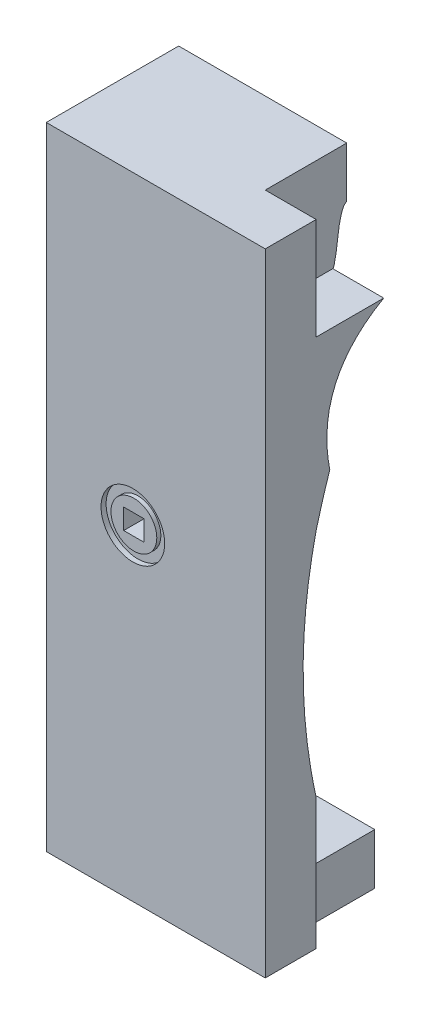
ISO-10303-21;
HEADER;
FILE_DESCRIPTION(('STEP AP214'),'2;1');
FILE_NAME('part.step','',(''),(''),'','','');
FILE_SCHEMA(('AUTOMOTIVE_DESIGN { 1 0 10303 214 1 1 1 1 }'));
ENDSEC;
DATA;
#1=APPLICATION_CONTEXT('core data for automotive mechanical design processes');
#2=APPLICATION_PROTOCOL_DEFINITION('international standard','automotive_design',2000,#1);
#3=PRODUCT_CONTEXT('',#1,'mechanical');
#4=PRODUCT('Part','Part','',(#3));
#5=PRODUCT_RELATED_PRODUCT_CATEGORY('part','',(#4));
#6=PRODUCT_DEFINITION_FORMATION('','',#4);
#7=PRODUCT_DEFINITION_CONTEXT('part definition',#1,'design');
#8=PRODUCT_DEFINITION('design','',#6,#7);
#9=PRODUCT_DEFINITION_SHAPE('','',#8);
#10=(LENGTH_UNIT() NAMED_UNIT(*) SI_UNIT(.MILLI.,.METRE.));
#11=(NAMED_UNIT(*) PLANE_ANGLE_UNIT() SI_UNIT($,.RADIAN.));
#12=(NAMED_UNIT(*) SI_UNIT($,.STERADIAN.) SOLID_ANGLE_UNIT());
#13=UNCERTAINTY_MEASURE_WITH_UNIT(LENGTH_MEASURE(1.E-05),#10,'distance_accuracy_value','');
#14=(GEOMETRIC_REPRESENTATION_CONTEXT(3) GLOBAL_UNCERTAINTY_ASSIGNED_CONTEXT((#13)) GLOBAL_UNIT_ASSIGNED_CONTEXT((#10,
#11,#12)) REPRESENTATION_CONTEXT('',''));
#15=CARTESIAN_POINT('',(0.,0.,0.));
#16=DIRECTION('',(0.,0.,1.));
#17=DIRECTION('',(1.,0.,0.));
#18=AXIS2_PLACEMENT_3D('',#15,#16,#17);
#19=CARTESIAN_POINT('',(0.,0.,26.));
#20=DIRECTION('',(0.,0.,1.));
#21=DIRECTION('',(1.,0.,0.));
#22=AXIS2_PLACEMENT_3D('',#19,#20,#21);
#23=PLANE('',#22);
#24=DIRECTION('',(-1.,0.,0.));
#25=VECTOR('',#24,1.);
#26=CARTESIAN_POINT('',(20.,10.,26.));
#27=LINE('',#26,#25);
#28=CARTESIAN_POINT('',(38.5,10.,26.));
#29=VERTEX_POINT('',#28);
#30=CARTESIAN_POINT('',(10.,10.,26.));
#31=VERTEX_POINT('',#30);
#32=EDGE_CURVE('E593',#29,#31,#27,.T.);
#33=ORIENTED_EDGE('',*,*,#32,.F.);
#34=DIRECTION('',(0.,1.,0.));
#35=VECTOR('',#34,1.);
#36=CARTESIAN_POINT('',(38.5,0.,26.));
#37=LINE('',#36,#35);
#38=CARTESIAN_POINT('',(38.5,0.,26.));
#39=VERTEX_POINT('',#38);
#40=EDGE_CURVE('E202',#39,#29,#37,.T.);
#41=ORIENTED_EDGE('',*,*,#40,.F.);
#42=DIRECTION('',(1.,0.,0.));
#43=VECTOR('',#42,1.);
#44=CARTESIAN_POINT('',(0.,0.,26.));
#45=LINE('',#44,#43);
#46=CARTESIAN_POINT('',(0.,0.,26.));
#47=VERTEX_POINT('',#46);
#48=EDGE_CURVE('E581',#47,#39,#45,.T.);
#49=ORIENTED_EDGE('',*,*,#48,.F.);
#50=DIRECTION('',(0.,1.,0.));
#51=VECTOR('',#50,1.);
#52=CARTESIAN_POINT('',(0.,0.,26.));
#53=LINE('',#52,#51);
#54=CARTESIAN_POINT('',(0.,124.,26.));
#55=VERTEX_POINT('',#54);
#56=EDGE_CURVE('E203',#47,#55,#53,.T.);
#57=ORIENTED_EDGE('',*,*,#56,.T.);
#58=DIRECTION('',(1.,0.,0.));
#59=VECTOR('',#58,1.);
#60=CARTESIAN_POINT('',(0.,124.,26.));
#61=LINE('',#60,#59);
#62=CARTESIAN_POINT('',(33.,124.,26.));
#63=VERTEX_POINT('',#62);
#64=EDGE_CURVE('E38',#55,#63,#61,.T.);
#65=ORIENTED_EDGE('',*,*,#64,.T.);
#66=DIRECTION('',(0.,1.,0.));
#67=VECTOR('',#66,1.);
#68=CARTESIAN_POINT('',(33.,124.,26.));
#69=LINE('',#68,#67);
#70=CARTESIAN_POINT('',(33.,114.,26.));
#71=VERTEX_POINT('',#70);
#72=EDGE_CURVE('E209',#71,#63,#69,.T.);
#73=ORIENTED_EDGE('',*,*,#72,.F.);
#74=CARTESIAN_POINT('',(8.85,114.,26.));
#75=CARTESIAN_POINT('',(17.2833333333333,114.,26.));
#76=CARTESIAN_POINT('',(25.7166666666667,114.,26.));
#77=CARTESIAN_POINT('',(34.15,114.,26.));
#78=(BOUNDED_CURVE() B_SPLINE_CURVE(3,(#74,#75,#76,#77),.UNSPECIFIED.,.F.,
.F.) B_SPLINE_CURVE_WITH_KNOTS((4,4),(-0.02415,0.00115),
.UNSPECIFIED.) CURVE() GEOMETRIC_REPRESENTATION_ITEM() RATIONAL_B_SPLINE_CURVE((1.,1.,1.,1.)) REPRESENTATION_ITEM(''));
#79=CARTESIAN_POINT('',(10.,114.,26.));
#80=VERTEX_POINT('',#79);
#81=EDGE_CURVE('E206',#71,#80,#78,.F.);
#82=ORIENTED_EDGE('',*,*,#81,.T.);
#83=DIRECTION('',(0.,1.,0.));
#84=VECTOR('',#83,1.);
#85=CARTESIAN_POINT('',(10.,124.,26.));
#86=LINE('',#85,#84);
#87=EDGE_CURVE('E189',#31,#80,#86,.T.);
#88=ORIENTED_EDGE('',*,*,#87,.F.);
#89=EDGE_LOOP('',(#33,#41,#49,#57,#65,#73,#82,#88));
#90=FACE_BOUND('',#89,.T.);
#91=ADVANCED_FACE('F34',(#90),#23,.F.);
#92=CARTESIAN_POINT('',(0.,0.,47.8));
#93=DIRECTION('',(0.,0.,-1.));
#94=DIRECTION('',(-1.,0.,0.));
#95=AXIS2_PLACEMENT_3D('',#92,#93,#94);
#96=PLANE('',#95);
#97=DIRECTION('',(0.,-1.,0.));
#98=VECTOR('',#97,1.);
#99=CARTESIAN_POINT('',(15.,62.,47.8));
#100=LINE('',#99,#98);
#101=CARTESIAN_POINT('',(15.,66.,47.8));
#102=VERTEX_POINT('',#101);
#103=CARTESIAN_POINT('',(15.,62.,47.8));
#104=VERTEX_POINT('',#103);
#105=EDGE_CURVE('E603',#102,#104,#100,.T.);
#106=ORIENTED_EDGE('',*,*,#105,.T.);
#107=DIRECTION('',(1.,0.,0.));
#108=VECTOR('',#107,1.);
#109=CARTESIAN_POINT('',(15.,62.,47.8));
#110=LINE('',#109,#108);
#111=CARTESIAN_POINT('',(19.,62.,47.8));
#112=VERTEX_POINT('',#111);
#113=EDGE_CURVE('E713',#104,#112,#110,.T.);
#114=ORIENTED_EDGE('',*,*,#113,.T.);
#115=DIRECTION('',(0.,1.,0.));
#116=VECTOR('',#115,1.);
#117=CARTESIAN_POINT('',(19.,62.,47.8));
#118=LINE('',#117,#116);
#119=CARTESIAN_POINT('',(19.,66.,47.8));
#120=VERTEX_POINT('',#119);
#121=EDGE_CURVE('E719',#112,#120,#118,.T.);
#122=ORIENTED_EDGE('',*,*,#121,.T.);
#123=DIRECTION('',(-1.,0.,0.));
#124=VECTOR('',#123,1.);
#125=CARTESIAN_POINT('',(15.,66.,47.8));
#126=LINE('',#125,#124);
#127=EDGE_CURVE('E715',#120,#102,#126,.T.);
#128=ORIENTED_EDGE('',*,*,#127,.T.);
#129=EDGE_LOOP('',(#106,#114,#122,#128));
#130=FACE_BOUND('',#129,.T.);
#131=ADVANCED_FACE('F353',(#130),#96,.F.);
#132=CARTESIAN_POINT('',(15.,62.,47.8));
#133=DIRECTION('',(0.,-1.,0.));
#134=DIRECTION('',(0.,0.,-1.));
#135=AXIS2_PLACEMENT_3D('',#132,#133,#134);
#136=PLANE('',#135);
#137=DIRECTION('',(1.,0.,0.));
#138=VECTOR('',#137,1.);
#139=CARTESIAN_POINT('',(15.,62.,51.8));
#140=LINE('',#139,#138);
#141=CARTESIAN_POINT('',(15.,62.,51.8));
#142=VERTEX_POINT('',#141);
#143=CARTESIAN_POINT('',(19.,62.,51.8));
#144=VERTEX_POINT('',#143);
#145=EDGE_CURVE('E44',#142,#144,#140,.T.);
#146=ORIENTED_EDGE('',*,*,#145,.T.);
#147=DIRECTION('',(0.,0.,1.));
#148=VECTOR('',#147,1.);
#149=CARTESIAN_POINT('',(19.,62.,47.8));
#150=LINE('',#149,#148);
#151=EDGE_CURVE('E53',#112,#144,#150,.T.);
#152=ORIENTED_EDGE('',*,*,#151,.F.);
#153=ORIENTED_EDGE('',*,*,#113,.F.);
#154=DIRECTION('',(0.,0.,1.));
#155=VECTOR('',#154,1.);
#156=CARTESIAN_POINT('',(15.,62.,47.8));
#157=LINE('',#156,#155);
#158=EDGE_CURVE('E73',#104,#142,#157,.T.);
#159=ORIENTED_EDGE('',*,*,#158,.T.);
#160=EDGE_LOOP('',(#146,#152,#153,#159));
#161=FACE_BOUND('',#160,.T.);
#162=ADVANCED_FACE('F702',(#161),#136,.F.);
#163=CARTESIAN_POINT('',(19.,62.,47.8));
#164=DIRECTION('',(1.,0.,0.));
#165=DIRECTION('',(0.,1.,0.));
#166=AXIS2_PLACEMENT_3D('',#163,#164,#165);
#167=PLANE('',#166);
#168=DIRECTION('',(0.,1.,0.));
#169=VECTOR('',#168,1.);
#170=CARTESIAN_POINT('',(19.,62.,51.8));
#171=LINE('',#170,#169);
#172=CARTESIAN_POINT('',(19.,66.,51.8));
#173=VERTEX_POINT('',#172);
#174=EDGE_CURVE('E717',#144,#173,#171,.T.);
#175=ORIENTED_EDGE('',*,*,#174,.T.);
#176=DIRECTION('',(0.,0.,1.));
#177=VECTOR('',#176,1.);
#178=CARTESIAN_POINT('',(19.,66.,47.8));
#179=LINE('',#178,#177);
#180=EDGE_CURVE('E726',#120,#173,#179,.T.);
#181=ORIENTED_EDGE('',*,*,#180,.F.);
#182=ORIENTED_EDGE('',*,*,#121,.F.);
#183=ORIENTED_EDGE('',*,*,#151,.T.);
#184=EDGE_LOOP('',(#175,#181,#182,#183));
#185=FACE_BOUND('',#184,.T.);
#186=ADVANCED_FACE('F707',(#185),#167,.F.);
#187=CARTESIAN_POINT('',(15.,66.,47.8));
#188=DIRECTION('',(0.,1.,0.));
#189=DIRECTION('',(0.,0.,1.));
#190=AXIS2_PLACEMENT_3D('',#187,#188,#189);
#191=PLANE('',#190);
#192=DIRECTION('',(-1.,0.,0.));
#193=VECTOR('',#192,1.);
#194=CARTESIAN_POINT('',(15.,66.,51.8));
#195=LINE('',#194,#193);
#196=CARTESIAN_POINT('',(15.,66.,51.8));
#197=VERTEX_POINT('',#196);
#198=EDGE_CURVE('E716',#173,#197,#195,.T.);
#199=ORIENTED_EDGE('',*,*,#198,.T.);
#200=DIRECTION('',(0.,0.,1.));
#201=VECTOR('',#200,1.);
#202=CARTESIAN_POINT('',(15.,66.,47.8));
#203=LINE('',#202,#201);
#204=EDGE_CURVE('E75',#102,#197,#203,.T.);
#205=ORIENTED_EDGE('',*,*,#204,.F.);
#206=ORIENTED_EDGE('',*,*,#127,.F.);
#207=ORIENTED_EDGE('',*,*,#180,.T.);
#208=EDGE_LOOP('',(#199,#205,#206,#207));
#209=FACE_BOUND('',#208,.T.);
#210=ADVANCED_FACE('F959',(#209),#191,.F.);
#211=CARTESIAN_POINT('',(15.,62.,47.8));
#212=DIRECTION('',(-1.,0.,0.));
#213=DIRECTION('',(0.,0.,1.));
#214=AXIS2_PLACEMENT_3D('',#211,#212,#213);
#215=PLANE('',#214);
#216=DIRECTION('',(0.,-1.,0.));
#217=VECTOR('',#216,1.);
#218=CARTESIAN_POINT('',(15.,62.,51.8));
#219=LINE('',#218,#217);
#220=EDGE_CURVE('E11',#197,#142,#219,.T.);
#221=ORIENTED_EDGE('',*,*,#220,.T.);
#222=ORIENTED_EDGE('',*,*,#158,.F.);
#223=ORIENTED_EDGE('',*,*,#105,.F.);
#224=ORIENTED_EDGE('',*,*,#204,.T.);
#225=EDGE_LOOP('',(#221,#222,#223,#224));
#226=FACE_BOUND('',#225,.T.);
#227=ADVANCED_FACE('F949',(#226),#215,.F.);
#228=CARTESIAN_POINT('',(17.,64.,51.8));
#229=DIRECTION('',(0.,0.,1.));
#230=DIRECTION('',(1.,0.,0.));
#231=AXIS2_PLACEMENT_3D('',#228,#229,#230);
#232=PLANE('',#231);
#233=ORIENTED_EDGE('',*,*,#220,.F.);
#234=ORIENTED_EDGE('',*,*,#198,.F.);
#235=ORIENTED_EDGE('',*,*,#174,.F.);
#236=ORIENTED_EDGE('',*,*,#145,.F.);
#237=EDGE_LOOP('',(#233,#234,#235,#236));
#238=FACE_BOUND('',#237,.T.);
#239=CARTESIAN_POINT('',(17.,64.,51.8));
#240=DIRECTION('',(0.,0.,1.));
#241=DIRECTION('',(1.,0.,0.));
#242=AXIS2_PLACEMENT_3D('',#239,#240,#241);
#243=CIRCLE('',#242,4.50000000000001);
#244=CARTESIAN_POINT('',(21.5,64.,51.8));
#245=VERTEX_POINT('',#244);
#246=EDGE_CURVE('E731',#245,#245,#243,.T.);
#247=ORIENTED_EDGE('',*,*,#246,.T.);
#248=EDGE_LOOP('',(#247));
#249=FACE_BOUND('',#248,.T.);
#250=ADVANCED_FACE('F939',(#238,#249),#232,.T.);
#251=CARTESIAN_POINT('',(17.,64.,51.8));
#252=DIRECTION('',(0.,0.,-1.));
#253=DIRECTION('',(-1.,0.,0.));
#254=AXIS2_PLACEMENT_3D('',#251,#252,#253);
#255=CYLINDRICAL_SURFACE('',#254,4.50000000000001);
#256=ORIENTED_EDGE('',*,*,#246,.F.);
#257=EDGE_LOOP('',(#256));
#258=FACE_BOUND('',#257,.T.);
#259=CARTESIAN_POINT('',(17.,64.,51.));
#260=DIRECTION('',(0.,0.,1.));
#261=DIRECTION('',(1.,0.,0.));
#262=AXIS2_PLACEMENT_3D('',#259,#260,#261);
#263=CIRCLE('',#262,4.50000000000001);
#264=CARTESIAN_POINT('',(21.5,64.,51.));
#265=VERTEX_POINT('',#264);
#266=EDGE_CURVE('E727',#265,#265,#263,.T.);
#267=ORIENTED_EDGE('',*,*,#266,.T.);
#268=EDGE_LOOP('',(#267));
#269=FACE_BOUND('',#268,.T.);
#270=ADVANCED_FACE('F695',(#258,#269),#255,.T.);
#271=CARTESIAN_POINT('',(17.,64.,51.));
#272=DIRECTION('',(0.,0.,1.));
#273=DIRECTION('',(1.,0.,0.));
#274=AXIS2_PLACEMENT_3D('',#271,#272,#273);
#275=PLANE('',#274);
#276=ORIENTED_EDGE('',*,*,#266,.F.);
#277=EDGE_LOOP('',(#276));
#278=FACE_BOUND('',#277,.T.);
#279=CARTESIAN_POINT('',(17.,64.,51.));
#280=DIRECTION('',(0.,0.,1.));
#281=DIRECTION('',(1.,0.,0.));
#282=AXIS2_PLACEMENT_3D('',#279,#280,#281);
#283=CIRCLE('',#282,6.25);
#284=CARTESIAN_POINT('',(23.25,64.,51.));
#285=VERTEX_POINT('',#284);
#286=EDGE_CURVE('E549',#285,#285,#283,.T.);
#287=ORIENTED_EDGE('',*,*,#286,.T.);
#288=EDGE_LOOP('',(#287));
#289=FACE_BOUND('',#288,.T.);
#290=ADVANCED_FACE('F689',(#278,#289),#275,.T.);
#291=CARTESIAN_POINT('',(30.,94.0996130936417,38.2321283621869));
#292=DIRECTION('',(1.,0.,0.));
#293=DIRECTION('',(0.,0.,-1.));
#294=AXIS2_PLACEMENT_3D('',#291,#292,#293);
#295=PLANE('',#294);
#296=CARTESIAN_POINT('',(30.,104.,28.7385001548335));
#297=CARTESIAN_POINT('',(30.,96.157986727643,42.4312611242323));
#298=CARTESIAN_POINT('',(30.,80.0824789192807,39.3274910454495));
#299=B_SPLINE_CURVE_WITH_KNOTS('',2,(#296,#297,#298),.UNSPECIFIED.,.F.,.F.,(3,3),(0.,1.),.UNSPECIFIED.);
#300=CARTESIAN_POINT('',(30.,104.,28.7385001548439));
#301=VERTEX_POINT('',#300);
#302=CARTESIAN_POINT('',(30.,80.0824789188781,39.3274910453718));
#303=VERTEX_POINT('',#302);
#304=EDGE_CURVE('E543',#301,#303,#299,.T.);
#305=ORIENTED_EDGE('',*,*,#304,.T.);
#306=CARTESIAN_POINT('',(30.,71.1550742932118,42.));
#307=CARTESIAN_POINT('',(30.,88.4149281860878,37.4415976663728));
#308=CARTESIAN_POINT('',(30.,104.,28.7385001548336));
#309=B_SPLINE_CURVE_WITH_KNOTS('',2,(#306,#307,#308),.UNSPECIFIED.,.F.,.F.,(3,3),(0.,1.),.UNSPECIFIED.);
#310=EDGE_CURVE('E537',#301,#303,#309,.F.);
#311=ORIENTED_EDGE('',*,*,#310,.F.);
#312=EDGE_LOOP('',(#305,#311));
#313=FACE_BOUND('',#312,.T.);
#314=ADVANCED_FACE('F569',(#313),#295,.T.);
#315=CARTESIAN_POINT('',(17.,64.,51.));
#316=DIRECTION('',(0.,0.,1.));
#317=DIRECTION('',(1.,0.,0.));
#318=AXIS2_PLACEMENT_3D('',#315,#316,#317);
#319=CYLINDRICAL_SURFACE('',#318,6.25);
#320=ORIENTED_EDGE('',*,*,#286,.F.);
#321=EDGE_LOOP('',(#320));
#322=FACE_BOUND('',#321,.T.);
#323=CARTESIAN_POINT('',(17.,64.,52.));
#324=DIRECTION('',(0.,0.,1.));
#325=DIRECTION('',(1.,0.,0.));
#326=AXIS2_PLACEMENT_3D('',#323,#324,#325);
#327=CIRCLE('',#326,6.25);
#328=CARTESIAN_POINT('',(23.25,64.,52.));
#329=VERTEX_POINT('',#328);
#330=EDGE_CURVE('E556',#329,#329,#327,.T.);
#331=ORIENTED_EDGE('',*,*,#330,.T.);
#332=EDGE_LOOP('',(#331));
#333=FACE_BOUND('',#332,.T.);
#334=ADVANCED_FACE('F566',(#322,#333),#319,.F.);
#335=DIRECTION('',(1.,0.,0.));
#336=VECTOR('',#335,1.);
#337=SURFACE_OF_LINEAR_EXTRUSION('',#299,#336);
#338=DIRECTION('',(1.,0.,0.));
#339=VECTOR('',#338,1.);
#340=CARTESIAN_POINT('',(30.,80.082478918643,39.327491045456));
#341=LINE('',#340,#339);
#342=CARTESIAN_POINT('',(43.,80.082478918643,39.327491045456));
#343=VERTEX_POINT('',#342);
#344=EDGE_CURVE('E550',#303,#343,#341,.T.);
#345=ORIENTED_EDGE('',*,*,#344,.F.);
#346=ORIENTED_EDGE('',*,*,#304,.F.);
#347=CARTESIAN_POINT('',(30.,104.,28.7385001548335));
#348=DIRECTION('',(1.,0.,0.));
#349=VECTOR('',#348,1.);
#350=LINE('',#347,#349);
#351=CARTESIAN_POINT('',(33.,104.,28.7385001548439));
#352=VERTEX_POINT('',#351);
#353=EDGE_CURVE('E328',#301,#352,#350,.T.);
#354=ORIENTED_EDGE('',*,*,#353,.T.);
#355=DIRECTION('',(1.,0.,0.));
#356=VECTOR('',#355,1.);
#357=CARTESIAN_POINT('',(10.,104.,28.7385001548336));
#358=LINE('',#357,#356);
#359=CARTESIAN_POINT('',(43.,104.,28.7385001548439));
#360=VERTEX_POINT('',#359);
#361=EDGE_CURVE('E491',#352,#360,#358,.T.);
#362=ORIENTED_EDGE('',*,*,#361,.T.);
#363=CARTESIAN_POINT('',(43.,104.,28.7385001548335));
#364=CARTESIAN_POINT('',(43.,96.157986727643,42.4312611242323));
#365=CARTESIAN_POINT('',(43.,80.0824789192807,39.3274910454495));
#366=B_SPLINE_CURVE_WITH_KNOTS('',2,(#363,#364,#365),.UNSPECIFIED.,.F.,.F.,(3,3),(0.,1.),.UNSPECIFIED.);
#367=EDGE_CURVE('E509',#343,#360,#366,.F.);
#368=ORIENTED_EDGE('',*,*,#367,.F.);
#369=EDGE_LOOP('',(#345,#346,#354,#362,#368));
#370=FACE_BOUND('',#369,.T.);
#371=ADVANCED_FACE('F478',(#370),#337,.F.);
#372=CARTESIAN_POINT('',(10.,71.1550742932118,42.));
#373=CARTESIAN_POINT('',(10.,56.2449177380193,45.4167075591528));
#374=CARTESIAN_POINT('',(10.,41.1085749826265,45.4191520784882));
#375=CARTESIAN_POINT('',(10.,25.7460460270664,42.0073335579909));
#376=B_SPLINE_CURVE_WITH_KNOTS('',3,(#372,#373,#374,#375),.UNSPECIFIED.,.F.,.F.,(4,4),(0.,
0.573838037424879),.UNSPECIFIED.);
#377=DIRECTION('',(1.,0.,0.));
#378=VECTOR('',#377,1.);
#379=SURFACE_OF_LINEAR_EXTRUSION('',#376,#378);
#380=CARTESIAN_POINT('',(43.,71.1550742932118,42.));
#381=CARTESIAN_POINT('',(43.,56.2449177380193,45.4167075591528));
#382=CARTESIAN_POINT('',(43.,41.1085749826265,45.4191520784882));
#383=CARTESIAN_POINT('',(43.,25.7460460270664,42.0073335579909));
#384=B_SPLINE_CURVE_WITH_KNOTS('',3,(#380,#381,#382,#383),.UNSPECIFIED.,.F.,.F.,(4,4),(0.,
0.573838037424879),.UNSPECIFIED.);
#385=CARTESIAN_POINT('',(43.,71.1550742932118,42.));
#386=VERTEX_POINT('',#385);
#387=CARTESIAN_POINT('',(43.,25.7460460270664,42.0073335579909));
#388=VERTEX_POINT('',#387);
#389=EDGE_CURVE('E500',#386,#388,#384,.T.);
#390=ORIENTED_EDGE('',*,*,#389,.T.);
#391=DIRECTION('',(1.,0.,0.));
#392=VECTOR('',#391,1.);
#393=CARTESIAN_POINT('',(10.,25.7460460270664,42.0073335579909));
#394=LINE('',#393,#392);
#395=CARTESIAN_POINT('',(10.,25.7460460270664,42.0073335579909));
#396=VERTEX_POINT('',#395);
#397=EDGE_CURVE('E655',#396,#388,#394,.T.);
#398=ORIENTED_EDGE('',*,*,#397,.F.);
#399=CARTESIAN_POINT('',(10.,71.1550742932118,42.));
#400=VERTEX_POINT('',#399);
#401=EDGE_CURVE('E482',#400,#396,#376,.T.);
#402=ORIENTED_EDGE('',*,*,#401,.F.);
#403=DIRECTION('',(1.,0.,0.));
#404=VECTOR('',#403,1.);
#405=CARTESIAN_POINT('',(10.,71.1550742932118,42.));
#406=LINE('',#405,#404);
#407=EDGE_CURVE('E653',#400,#386,#406,.T.);
#408=ORIENTED_EDGE('',*,*,#407,.T.);
#409=EDGE_LOOP('',(#390,#398,#402,#408));
#410=FACE_BOUND('',#409,.T.);
#411=ADVANCED_FACE('F473',(#410),#379,.F.);
#412=CARTESIAN_POINT('',(10.,71.1550742932118,42.));
#413=CARTESIAN_POINT('',(10.,88.4149281860878,37.4415976663728));
#414=CARTESIAN_POINT('',(10.,104.,28.7385001548336));
#415=B_SPLINE_CURVE_WITH_KNOTS('',2,(#412,#413,#414),.UNSPECIFIED.,.F.,.F.,(3,3),(0.,1.),.UNSPECIFIED.);
#416=DIRECTION('',(1.,0.,0.));
#417=VECTOR('',#416,1.);
#418=SURFACE_OF_LINEAR_EXTRUSION('',#415,#417);
#419=ORIENTED_EDGE('',*,*,#344,.T.);
#420=CARTESIAN_POINT('',(43.,71.1550742932118,42.));
#421=CARTESIAN_POINT('',(43.,88.4149281860878,37.4415976663728));
#422=CARTESIAN_POINT('',(43.,104.,28.7385001548336));
#423=B_SPLINE_CURVE_WITH_KNOTS('',2,(#420,#421,#422),.UNSPECIFIED.,.F.,.F.,(3,3),(0.,1.),.UNSPECIFIED.);
#424=EDGE_CURVE('E504',#386,#343,#423,.T.);
#425=ORIENTED_EDGE('',*,*,#424,.F.);
#426=ORIENTED_EDGE('',*,*,#407,.F.);
#427=CARTESIAN_POINT('',(10.,104.,28.7385001548336));
#428=VERTEX_POINT('',#427);
#429=EDGE_CURVE('E319',#400,#428,#415,.T.);
#430=ORIENTED_EDGE('',*,*,#429,.T.);
#431=CARTESIAN_POINT('',(10.,104.,28.7385001548336));
#432=DIRECTION('',(1.,0.,0.));
#433=VECTOR('',#432,1.);
#434=LINE('',#431,#433);
#435=EDGE_CURVE('E326',#428,#301,#434,.T.);
#436=ORIENTED_EDGE('',*,*,#435,.T.);
#437=ORIENTED_EDGE('',*,*,#310,.T.);
#438=EDGE_LOOP('',(#419,#425,#426,#430,#436,#437));
#439=FACE_BOUND('',#438,.T.);
#440=ADVANCED_FACE('F477',(#439),#418,.T.);
#441=CARTESIAN_POINT('',(10.,25.7460460270664,42.0073335579909));
#442=DIRECTION('',(0.,-1.,0.));
#443=DIRECTION('',(1.,0.,0.));
#444=AXIS2_PLACEMENT_3D('',#441,#442,#443);
#445=PLANE('',#444);
#446=DIRECTION('',(0.,0.,1.));
#447=VECTOR('',#446,1.);
#448=CARTESIAN_POINT('',(38.5,25.7460460270664,52.));
#449=LINE('',#448,#447);
#450=CARTESIAN_POINT('',(38.5,25.746045360121,41.908487470257));
#451=VERTEX_POINT('',#450);
#452=CARTESIAN_POINT('',(38.5,25.7460460270664,42.));
#453=VERTEX_POINT('',#452);
#454=EDGE_CURVE('E449',#451,#453,#449,.T.);
#455=ORIENTED_EDGE('',*,*,#454,.F.);
#456=DIRECTION('',(1.,0.,0.));
#457=VECTOR('',#456,1.);
#458=CARTESIAN_POINT('',(24.25,25.7460460270664,41.90847221096));
#459=LINE('',#458,#457);
#460=CARTESIAN_POINT('',(10.,25.7460447630057,41.9085011242542));
#461=VERTEX_POINT('',#460);
#462=EDGE_CURVE('E323',#461,#451,#459,.T.);
#463=ORIENTED_EDGE('',*,*,#462,.F.);
#464=DIRECTION('',(0.,0.,-1.));
#465=VECTOR('',#464,1.);
#466=CARTESIAN_POINT('',(10.,25.7460460270664,42.0073335579909));
#467=LINE('',#466,#465);
#468=EDGE_CURVE('E440',#396,#461,#467,.T.);
#469=ORIENTED_EDGE('',*,*,#468,.F.);
#470=ORIENTED_EDGE('',*,*,#397,.T.);
#471=DIRECTION('',(0.,0.,-1.));
#472=VECTOR('',#471,1.);
#473=CARTESIAN_POINT('',(43.,25.7460460270664,42.0073335579909));
#474=LINE('',#473,#472);
#475=CARTESIAN_POINT('',(43.,25.7460460270664,42.));
#476=VERTEX_POINT('',#475);
#477=EDGE_CURVE('E488',#388,#476,#474,.T.);
#478=ORIENTED_EDGE('',*,*,#477,.T.);
#479=DIRECTION('',(1.,0.,0.));
#480=VECTOR('',#479,1.);
#481=CARTESIAN_POINT('',(20.,25.7460460270664,42.));
#482=LINE('',#481,#480);
#483=EDGE_CURVE('E647',#453,#476,#482,.T.);
#484=ORIENTED_EDGE('',*,*,#483,.F.);
#485=EDGE_LOOP('',(#455,#463,#469,#470,#478,#484));
#486=FACE_BOUND('',#485,.T.);
#487=ADVANCED_FACE('F480',(#486),#445,.F.);
#488=CARTESIAN_POINT('',(8.57500000000001,10.,38.));
#489=CARTESIAN_POINT('',(19.025,10.,38.));
#490=CARTESIAN_POINT('',(29.475,10.,38.));
#491=CARTESIAN_POINT('',(39.925,10.,38.));
#492=CARTESIAN_POINT('',(8.57500000000001,10.,42.));
#493=CARTESIAN_POINT('',(19.025,10.,42.));
#494=CARTESIAN_POINT('',(29.475,10.,42.));
#495=CARTESIAN_POINT('',(39.925,10.,42.));
#496=CARTESIAN_POINT('',(8.57500000000001,30.,42.));
#497=CARTESIAN_POINT('',(19.025,30.,42.));
#498=CARTESIAN_POINT('',(29.475,30.,42.));
#499=CARTESIAN_POINT('',(39.925,30.,42.));
#500=(BOUNDED_SURFACE() B_SPLINE_SURFACE(2,3,((#488,#489,#490,#491),(#492,#493,#494,#495),(#496,
#497,#498,#499)),.UNSPECIFIED.,.F.,.F.,.F.) B_SPLINE_SURFACE_WITH_KNOTS((3,3),(4,4),(0.,1.),
(-0.011425,0.019925),
.UNSPECIFIED.) GEOMETRIC_REPRESENTATION_ITEM() RATIONAL_B_SPLINE_SURFACE(((1.,1.,1.,1.),
(0.707106781186548,0.707106781186548,0.707106781186548,0.707106781186548),(1.,1.,1.,1.))) REPRESENTATION_ITEM('') SURFACE());
#501=CARTESIAN_POINT('',(10.,10.,38.));
#502=CARTESIAN_POINT('',(10.,10.,42.));
#503=CARTESIAN_POINT('',(10.,30.,42.));
#504=(BOUNDED_CURVE() B_SPLINE_CURVE(2,(#501,#502,#503),.UNSPECIFIED.,.F.,
.F.) B_SPLINE_CURVE_WITH_KNOTS((3,3),(0.,1.),
.UNSPECIFIED.) CURVE() GEOMETRIC_REPRESENTATION_ITEM() RATIONAL_B_SPLINE_CURVE((1.,
0.707106781186548,1.)) REPRESENTATION_ITEM(''));
#505=CARTESIAN_POINT('',(10.,10.,38.));
#506=VERTEX_POINT('',#505);
#507=EDGE_CURVE('E382',#461,#506,#504,.F.);
#508=CARTESIAN_POINT('',(38.5,30.,42.));
#509=CARTESIAN_POINT('',(38.5,10.,42.));
#510=CARTESIAN_POINT('',(38.5,10.,38.));
#511=(BOUNDED_CURVE() B_SPLINE_CURVE(2,(#508,#509,#510),.UNSPECIFIED.,.F.,
.F.) B_SPLINE_CURVE_WITH_KNOTS((3,3),(0.,1.),
.UNSPECIFIED.) CURVE() GEOMETRIC_REPRESENTATION_ITEM() RATIONAL_B_SPLINE_CURVE((1.,
0.707106781186548,1.)) REPRESENTATION_ITEM(''));
#512=CARTESIAN_POINT('',(38.5,10.,38.));
#513=VERTEX_POINT('',#512);
#514=EDGE_CURVE('E333',#513,#451,#511,.F.);
#515=CARTESIAN_POINT('',(39.925,10.,38.));
#516=CARTESIAN_POINT('',(29.475,10.,38.));
#517=CARTESIAN_POINT('',(19.025,10.,38.));
#518=CARTESIAN_POINT('',(8.57500000000001,10.,38.));
#519=(BOUNDED_CURVE() B_SPLINE_CURVE(3,(#515,#516,#517,#518),.UNSPECIFIED.,.F.,
.F.) B_SPLINE_CURVE_WITH_KNOTS((4,4),(-0.011425,0.019925),
.UNSPECIFIED.) CURVE() GEOMETRIC_REPRESENTATION_ITEM() RATIONAL_B_SPLINE_CURVE((1.,1.,1.,1.)) REPRESENTATION_ITEM(''));
#520=EDGE_CURVE('E413',#506,#513,#519,.F.);
#521=ORIENTED_EDGE('',*,*,#507,.F.);
#522=ORIENTED_EDGE('',*,*,#462,.T.);
#523=ORIENTED_EDGE('',*,*,#514,.F.);
#524=ORIENTED_EDGE('',*,*,#520,.F.);
#525=EDGE_LOOP('',(#521,#522,#523,#524));
#526=FACE_BOUND('',#525,.T.);
#527=ADVANCED_FACE('F249',(#526),#500,.T.);
#528=CARTESIAN_POINT('',(20.,30.,42.));
#529=DIRECTION('',(0.,0.,1.));
#530=DIRECTION('',(1.,0.,0.));
#531=AXIS2_PLACEMENT_3D('',#528,#529,#530);
#532=PLANE('',#531);
#533=DIRECTION('',(0.,1.,0.));
#534=VECTOR('',#533,1.);
#535=CARTESIAN_POINT('',(38.5,0.,42.));
#536=LINE('',#535,#534);
#537=CARTESIAN_POINT('',(38.5,0.,42.));
#538=VERTEX_POINT('',#537);
#539=EDGE_CURVE('E396',#538,#453,#536,.T.);
#540=ORIENTED_EDGE('',*,*,#539,.T.);
#541=ORIENTED_EDGE('',*,*,#483,.T.);
#542=DIRECTION('',(0.,1.,0.));
#543=VECTOR('',#542,1.);
#544=CARTESIAN_POINT('',(43.,124.,42.));
#545=LINE('',#544,#543);
#546=CARTESIAN_POINT('',(43.,0.,42.));
#547=VERTEX_POINT('',#546);
#548=EDGE_CURVE('E641',#547,#476,#545,.T.);
#549=ORIENTED_EDGE('',*,*,#548,.F.);
#550=DIRECTION('',(-1.,0.,0.));
#551=VECTOR('',#550,1.);
#552=CARTESIAN_POINT('',(43.,0.,42.));
#553=LINE('',#552,#551);
#554=EDGE_CURVE('E630',#547,#538,#553,.T.);
#555=ORIENTED_EDGE('',*,*,#554,.T.);
#556=EDGE_LOOP('',(#540,#541,#549,#555));
#557=FACE_BOUND('',#556,.T.);
#558=ADVANCED_FACE('F464',(#557),#532,.F.);
#559=CARTESIAN_POINT('',(38.5,0.,52.));
#560=DIRECTION('',(-1.,0.,0.));
#561=DIRECTION('',(0.,0.,1.));
#562=AXIS2_PLACEMENT_3D('',#559,#560,#561);
#563=PLANE('',#562);
#564=DIRECTION('',(0.,0.,-1.));
#565=VECTOR('',#564,1.);
#566=CARTESIAN_POINT('',(38.5,0.,52.));
#567=LINE('',#566,#565);
#568=EDGE_CURVE('E626',#538,#39,#567,.T.);
#569=ORIENTED_EDGE('',*,*,#568,.T.);
#570=ORIENTED_EDGE('',*,*,#40,.T.);
#571=DIRECTION('',(0.,0.,-1.));
#572=VECTOR('',#571,1.);
#573=CARTESIAN_POINT('',(38.5,10.,52.));
#574=LINE('',#573,#572);
#575=EDGE_CURVE('E280',#513,#29,#574,.T.);
#576=ORIENTED_EDGE('',*,*,#575,.F.);
#577=ORIENTED_EDGE('',*,*,#514,.T.);
#578=ORIENTED_EDGE('',*,*,#454,.T.);
#579=ORIENTED_EDGE('',*,*,#539,.F.);
#580=EDGE_LOOP('',(#569,#570,#576,#577,#578,#579));
#581=FACE_BOUND('',#580,.T.);
#582=ADVANCED_FACE('F448',(#581),#563,.F.);
#583=CARTESIAN_POINT('',(43.,0.,0.));
#584=DIRECTION('',(-1.,0.,0.));
#585=DIRECTION('',(0.,-1.,0.));
#586=AXIS2_PLACEMENT_3D('',#583,#584,#585);
#587=PLANE('',#586);
#588=ORIENTED_EDGE('',*,*,#424,.T.);
#589=ORIENTED_EDGE('',*,*,#367,.T.);
#590=DIRECTION('',(0.,0.,1.));
#591=VECTOR('',#590,1.);
#592=CARTESIAN_POINT('',(43.,104.,28.7385001548336));
#593=LINE('',#592,#591);
#594=CARTESIAN_POINT('',(43.,104.,42.));
#595=VERTEX_POINT('',#594);
#596=EDGE_CURVE('E501',#360,#595,#593,.T.);
#597=ORIENTED_EDGE('',*,*,#596,.T.);
#598=CARTESIAN_POINT('',(43.,124.,42.));
#599=VERTEX_POINT('',#598);
#600=EDGE_CURVE('E644',#595,#599,#545,.T.);
#601=ORIENTED_EDGE('',*,*,#600,.T.);
#602=DIRECTION('',(0.,0.,1.));
#603=VECTOR('',#602,1.);
#604=CARTESIAN_POINT('',(43.,124.,42.));
#605=LINE('',#604,#603);
#606=CARTESIAN_POINT('',(43.,124.,52.));
#607=VERTEX_POINT('',#606);
#608=EDGE_CURVE('E638',#599,#607,#605,.T.);
#609=ORIENTED_EDGE('',*,*,#608,.T.);
#610=DIRECTION('',(0.,-1.,0.));
#611=VECTOR('',#610,1.);
#612=CARTESIAN_POINT('',(43.,124.,52.));
#613=LINE('',#612,#611);
#614=CARTESIAN_POINT('',(43.,0.,52.));
#615=VERTEX_POINT('',#614);
#616=EDGE_CURVE('E635',#607,#615,#613,.T.);
#617=ORIENTED_EDGE('',*,*,#616,.T.);
#618=DIRECTION('',(0.,0.,-1.));
#619=VECTOR('',#618,1.);
#620=CARTESIAN_POINT('',(43.,0.,42.));
#621=LINE('',#620,#619);
#622=EDGE_CURVE('E633',#615,#547,#621,.T.);
#623=ORIENTED_EDGE('',*,*,#622,.T.);
#624=ORIENTED_EDGE('',*,*,#548,.T.);
#625=ORIENTED_EDGE('',*,*,#477,.F.);
#626=ORIENTED_EDGE('',*,*,#389,.F.);
#627=EDGE_LOOP('',(#588,#589,#597,#601,#609,#617,#623,#624,#625,#626));
#628=FACE_BOUND('',#627,.T.);
#629=ADVANCED_FACE('F469',(#628),#587,.F.);
#630=CARTESIAN_POINT('',(0.,0.,52.));
#631=DIRECTION('',(0.,0.,1.));
#632=DIRECTION('',(1.,0.,0.));
#633=AXIS2_PLACEMENT_3D('',#630,#631,#632);
#634=PLANE('',#633);
#635=ORIENTED_EDGE('',*,*,#330,.F.);
#636=EDGE_LOOP('',(#635));
#637=FACE_BOUND('',#636,.T.);
#638=DIRECTION('',(0.,-1.,0.));
#639=VECTOR('',#638,1.);
#640=CARTESIAN_POINT('',(0.,124.,52.));
#641=LINE('',#640,#639);
#642=CARTESIAN_POINT('',(0.,124.,52.));
#643=VERTEX_POINT('',#642);
#644=CARTESIAN_POINT('',(0.,0.,52.));
#645=VERTEX_POINT('',#644);
#646=EDGE_CURVE('E623',#643,#645,#641,.T.);
#647=ORIENTED_EDGE('',*,*,#646,.T.);
#648=DIRECTION('',(1.,0.,0.));
#649=VECTOR('',#648,1.);
#650=CARTESIAN_POINT('',(0.,0.,52.));
#651=LINE('',#650,#649);
#652=EDGE_CURVE('E621',#645,#615,#651,.T.);
#653=ORIENTED_EDGE('',*,*,#652,.T.);
#654=ORIENTED_EDGE('',*,*,#616,.F.);
#655=DIRECTION('',(-1.,0.,0.));
#656=VECTOR('',#655,1.);
#657=CARTESIAN_POINT('',(0.,124.,52.));
#658=LINE('',#657,#656);
#659=EDGE_CURVE('E392',#607,#643,#658,.T.);
#660=ORIENTED_EDGE('',*,*,#659,.T.);
#661=EDGE_LOOP('',(#647,#653,#654,#660));
#662=FACE_BOUND('',#661,.T.);
#663=ADVANCED_FACE('F297',(#637,#662),#634,.T.);
#664=CARTESIAN_POINT('',(0.,0.,10.));
#665=DIRECTION('',(-1.,0.,0.));
#666=DIRECTION('',(0.,-1.,0.));
#667=AXIS2_PLACEMENT_3D('',#664,#665,#666);
#668=PLANE('',#667);
#669=ORIENTED_EDGE('',*,*,#56,.F.);
#670=DIRECTION('',(0.,0.,-1.));
#671=VECTOR('',#670,1.);
#672=CARTESIAN_POINT('',(0.,0.,10.));
#673=LINE('',#672,#671);
#674=EDGE_CURVE('E220',#645,#47,#673,.T.);
#675=ORIENTED_EDGE('',*,*,#674,.F.);
#676=ORIENTED_EDGE('',*,*,#646,.F.);
#677=DIRECTION('',(0.,0.,-1.));
#678=VECTOR('',#677,1.);
#679=CARTESIAN_POINT('',(0.,124.,10.));
#680=LINE('',#679,#678);
#681=EDGE_CURVE('E614',#643,#55,#680,.T.);
#682=ORIENTED_EDGE('',*,*,#681,.T.);
#683=EDGE_LOOP('',(#669,#675,#676,#682));
#684=FACE_BOUND('',#683,.T.);
#685=ADVANCED_FACE('F676',(#684),#668,.T.);
#686=CARTESIAN_POINT('',(10.,104.,28.7385001548336));
#687=DIRECTION('',(0.,1.,0.));
#688=DIRECTION('',(0.,0.,1.));
#689=AXIS2_PLACEMENT_3D('',#686,#687,#688);
#690=PLANE('',#689);
#691=DIRECTION('',(0.,0.,1.));
#692=VECTOR('',#691,1.);
#693=CARTESIAN_POINT('',(33.,104.,39.));
#694=LINE('',#693,#692);
#695=CARTESIAN_POINT('',(33.,104.,42.));
#696=VERTEX_POINT('',#695);
#697=EDGE_CURVE('E380',#352,#696,#694,.T.);
#698=ORIENTED_EDGE('',*,*,#697,.T.);
#699=DIRECTION('',(1.,0.,0.));
#700=VECTOR('',#699,1.);
#701=CARTESIAN_POINT('',(10.,104.,42.));
#702=LINE('',#701,#700);
#703=EDGE_CURVE('E496',#696,#595,#702,.T.);
#704=ORIENTED_EDGE('',*,*,#703,.T.);
#705=ORIENTED_EDGE('',*,*,#596,.F.);
#706=ORIENTED_EDGE('',*,*,#361,.F.);
#707=EDGE_LOOP('',(#698,#704,#705,#706));
#708=FACE_BOUND('',#707,.T.);
#709=ADVANCED_FACE('F568',(#708),#690,.T.);
#710=ORIENTED_EDGE('',*,*,#600,.F.);
#711=ORIENTED_EDGE('',*,*,#703,.F.);
#712=DIRECTION('',(0.,1.,0.));
#713=VECTOR('',#712,1.);
#714=CARTESIAN_POINT('',(33.,104.,42.));
#715=LINE('',#714,#713);
#716=CARTESIAN_POINT('',(33.,124.,42.));
#717=VERTEX_POINT('',#716);
#718=EDGE_CURVE('E645',#696,#717,#715,.T.);
#719=ORIENTED_EDGE('',*,*,#718,.T.);
#720=DIRECTION('',(-1.,0.,0.));
#721=VECTOR('',#720,1.);
#722=CARTESIAN_POINT('',(43.,124.,42.));
#723=LINE('',#722,#721);
#724=EDGE_CURVE('E399',#599,#717,#723,.T.);
#725=ORIENTED_EDGE('',*,*,#724,.F.);
#726=EDGE_LOOP('',(#710,#711,#719,#725));
#727=FACE_BOUND('',#726,.T.);
#728=ADVANCED_FACE('F468',(#727),#532,.F.);
#729=CARTESIAN_POINT('',(0.,124.,10.));
#730=DIRECTION('',(0.,1.,0.));
#731=DIRECTION('',(0.,0.,1.));
#732=AXIS2_PLACEMENT_3D('',#729,#730,#731);
#733=PLANE('',#732);
#734=ORIENTED_EDGE('',*,*,#64,.F.);
#735=ORIENTED_EDGE('',*,*,#681,.F.);
#736=ORIENTED_EDGE('',*,*,#659,.F.);
#737=ORIENTED_EDGE('',*,*,#608,.F.);
#738=ORIENTED_EDGE('',*,*,#724,.T.);
#739=DIRECTION('',(0.,0.,-1.));
#740=VECTOR('',#739,1.);
#741=CARTESIAN_POINT('',(33.,124.,39.));
#742=LINE('',#741,#740);
#743=EDGE_CURVE('E393',#717,#63,#742,.T.);
#744=ORIENTED_EDGE('',*,*,#743,.T.);
#745=EDGE_LOOP('',(#734,#735,#736,#737,#738,#744));
#746=FACE_BOUND('',#745,.T.);
#747=ADVANCED_FACE('F294',(#746),#733,.T.);
#748=CARTESIAN_POINT('',(10.,124.,52.));
#749=DIRECTION('',(-1.,0.,0.));
#750=DIRECTION('',(0.,-1.,0.));
#751=AXIS2_PLACEMENT_3D('',#748,#749,#750);
#752=PLANE('',#751);
#753=DIRECTION('',(0.,0.,1.));
#754=VECTOR('',#753,1.);
#755=CARTESIAN_POINT('',(10.,10.,-0.002000000000002));
#756=LINE('',#755,#754);
#757=EDGE_CURVE('E198',#31,#506,#756,.T.);
#758=ORIENTED_EDGE('',*,*,#757,.F.);
#759=ORIENTED_EDGE('',*,*,#87,.T.);
#760=CARTESIAN_POINT('',(10.,104.,28.));
#761=CARTESIAN_POINT('',(10.,114.,28.0000000000001));
#762=CARTESIAN_POINT('',(10.,114.,26.));
#763=(BOUNDED_CURVE() B_SPLINE_CURVE(2,(#760,#761,#762),.UNSPECIFIED.,.F.,
.F.) B_SPLINE_CURVE_WITH_KNOTS((3,3),(0.,1.),
.UNSPECIFIED.) CURVE() GEOMETRIC_REPRESENTATION_ITEM() RATIONAL_B_SPLINE_CURVE((1.,
0.707106781186545,1.)) REPRESENTATION_ITEM(''));
#764=CARTESIAN_POINT('',(10.,108.888621214896,27.744737786299));
#765=VERTEX_POINT('',#764);
#766=EDGE_CURVE('E194',#80,#765,#763,.F.);
#767=ORIENTED_EDGE('',*,*,#766,.T.);
#768=CARTESIAN_POINT('',(10.,104.,28.7385001548507));
#769=CARTESIAN_POINT('',(10.,104.000000000017,28.2926284314508));
#770=CARTESIAN_POINT('',(10.,108.888619487037,27.744722321872));
#771=(BOUNDED_CURVE() B_SPLINE_CURVE(2,(#768,#769,#770),.UNSPECIFIED.,.F.,
.F.) B_SPLINE_CURVE_WITH_KNOTS((3,3),(0.,1.),
.UNSPECIFIED.) CURVE() GEOMETRIC_REPRESENTATION_ITEM() RATIONAL_B_SPLINE_CURVE((1.,
0.745446347154539,1.)) REPRESENTATION_ITEM(''));
#772=EDGE_CURVE('E316',#765,#428,#771,.F.);
#773=ORIENTED_EDGE('',*,*,#772,.T.);
#774=ORIENTED_EDGE('',*,*,#429,.F.);
#775=ORIENTED_EDGE('',*,*,#401,.T.);
#776=ORIENTED_EDGE('',*,*,#468,.T.);
#777=ORIENTED_EDGE('',*,*,#507,.T.);
#778=EDGE_LOOP('',(#758,#759,#767,#773,#774,#775,#776,#777));
#779=FACE_BOUND('',#778,.T.);
#780=ADVANCED_FACE('F191',(#779),#752,.F.);
#781=CARTESIAN_POINT('',(34.15,108.888619487028,27.7447223218731));
#782=CARTESIAN_POINT('',(25.7166666666667,108.888619487274,27.7447223218455));
#783=CARTESIAN_POINT('',(17.2833333333333,108.888619487091,27.744722321866));
#784=CARTESIAN_POINT('',(8.85,108.888619487028,27.7447223218731));
#785=CARTESIAN_POINT('',(34.15,104.,28.2926284313861));
#786=CARTESIAN_POINT('',(25.7166666666667,104.000000000468,28.2926284312545));
#787=CARTESIAN_POINT('',(17.2833333333333,104.000000000117,28.2926284319128));
#788=CARTESIAN_POINT('',(8.85,104.,28.2926284313861));
#789=CARTESIAN_POINT('',(34.15,104.,28.7385001548569));
#790=CARTESIAN_POINT('',(25.7166666666667,104.,28.7385001547253));
#791=CARTESIAN_POINT('',(17.2833333333334,104.,28.738500154813));
#792=CARTESIAN_POINT('',(8.85,104.,28.7385001548569));
#793=(BOUNDED_SURFACE() B_SPLINE_SURFACE(2,3,((#781,#782,#783,#784),(#785,#786,#787,#788),(#789,
#790,#791,#792)),.UNSPECIFIED.,.F.,.F.,.F.) B_SPLINE_SURFACE_WITH_KNOTS((3,3),(4,4),(0.,1.),
(-0.01265,0.01265),
.UNSPECIFIED.) GEOMETRIC_REPRESENTATION_ITEM() RATIONAL_B_SPLINE_SURFACE(((1.,1.,1.,1.),
(0.745446347154539,0.745446347154539,0.745446347154539,0.745446347154539),(1.,1.,1.,1.))) REPRESENTATION_ITEM('') SURFACE());
#794=CARTESIAN_POINT('',(33.,108.888619487059,27.7447223218696));
#795=CARTESIAN_POINT('',(32.0416666666667,108.888619487058,27.7447223218697));
#796=CARTESIAN_POINT('',(31.0833333333333,108.888619487057,27.7447223218698));
#797=CARTESIAN_POINT('',(29.1666666666667,108.888619487055,27.74472232187));
#798=CARTESIAN_POINT('',(28.2083333333333,108.888619487054,27.7447223218701));
#799=CARTESIAN_POINT('',(26.2916666666667,108.888619487053,27.7447223218703));
#800=CARTESIAN_POINT('',(25.3333333333333,108.888619487052,27.7447223218704));
#801=CARTESIAN_POINT('',(23.4166666666667,108.88861948705,27.7447223218706));
#802=CARTESIAN_POINT('',(22.4583333333333,108.888619487049,27.7447223218707));
#803=CARTESIAN_POINT('',(20.5416666666667,108.888619487047,27.7447223218709));
#804=CARTESIAN_POINT('',(19.5833333333333,108.888619487046,27.744722321871));
#805=CARTESIAN_POINT('',(17.6666666666667,108.888619487044,27.7447223218712));
#806=CARTESIAN_POINT('',(16.7083333333333,108.888619487044,27.7447223218713));
#807=CARTESIAN_POINT('',(14.7916666666667,108.888619487042,27.7447223218715));
#808=CARTESIAN_POINT('',(13.8333333333333,108.888619487041,27.7447223218716));
#809=CARTESIAN_POINT('',(11.9166666666667,108.888619487039,27.7447223218718));
#810=CARTESIAN_POINT('',(10.9583333333333,108.888619487038,27.7447223218719));
#811=CARTESIAN_POINT('',(10.,108.888619487037,27.744722321872));
#812=B_SPLINE_CURVE_WITH_KNOTS('',3,(#794,#795,#796,#797,#798,#799,#800,#801,#802,#803,#804,
#805,#806,#807,#808,#809,#810,#811),.UNSPECIFIED.,.F.,.F.,(4,2,2,2,2,2,2,2,4),(0.,
2.87499999999998,5.74999999999998,8.62499999999997,11.5,14.375,17.25,20.125,23.),.UNSPECIFIED.);
#813=CARTESIAN_POINT('',(33.,108.888621053008,27.7447363460717));
#814=VERTEX_POINT('',#813);
#815=EDGE_CURVE('E218',#814,#765,#812,.T.);
#816=CARTESIAN_POINT('',(33.,108.888619487059,27.7447223218696));
#817=CARTESIAN_POINT('',(33.,104.000000000059,28.2926284313729));
#818=CARTESIAN_POINT('',(33.,104.,28.7385001548403));
#819=(BOUNDED_CURVE() B_SPLINE_CURVE(2,(#816,#817,#818),.UNSPECIFIED.,.F.,
.F.) B_SPLINE_CURVE_WITH_KNOTS((3,3),(0.,1.),
.UNSPECIFIED.) CURVE() GEOMETRIC_REPRESENTATION_ITEM() RATIONAL_B_SPLINE_CURVE((1.,
0.745446347154539,1.)) REPRESENTATION_ITEM(''));
#820=EDGE_CURVE('E334',#352,#814,#819,.F.);
#821=ORIENTED_EDGE('',*,*,#772,.F.);
#822=ORIENTED_EDGE('',*,*,#815,.F.);
#823=ORIENTED_EDGE('',*,*,#820,.F.);
#824=ORIENTED_EDGE('',*,*,#353,.F.);
#825=ORIENTED_EDGE('',*,*,#435,.F.);
#826=EDGE_LOOP('',(#821,#822,#823,#824,#825));
#827=FACE_BOUND('',#826,.T.);
#828=ADVANCED_FACE('F293',(#827),#793,.T.);
#829=CARTESIAN_POINT('',(33.,124.,39.));
#830=DIRECTION('',(-1.,0.,0.));
#831=DIRECTION('',(0.,-1.,0.));
#832=AXIS2_PLACEMENT_3D('',#829,#830,#831);
#833=PLANE('',#832);
#834=CARTESIAN_POINT('',(33.,114.,26.));
#835=CARTESIAN_POINT('',(33.,114.,28.0000000000001));
#836=CARTESIAN_POINT('',(33.,104.,28.));
#837=(BOUNDED_CURVE() B_SPLINE_CURVE(2,(#834,#835,#836),.UNSPECIFIED.,.F.,
.F.) B_SPLINE_CURVE_WITH_KNOTS((3,3),(0.,1.),
.UNSPECIFIED.) CURVE() GEOMETRIC_REPRESENTATION_ITEM() RATIONAL_B_SPLINE_CURVE((1.,
0.707106781186545,1.)) REPRESENTATION_ITEM(''));
#838=EDGE_CURVE('E221',#814,#71,#837,.F.);
#839=ORIENTED_EDGE('',*,*,#838,.T.);
#840=ORIENTED_EDGE('',*,*,#72,.T.);
#841=ORIENTED_EDGE('',*,*,#743,.F.);
#842=ORIENTED_EDGE('',*,*,#718,.F.);
#843=ORIENTED_EDGE('',*,*,#697,.F.);
#844=ORIENTED_EDGE('',*,*,#820,.T.);
#845=EDGE_LOOP('',(#839,#840,#841,#842,#843,#844));
#846=FACE_BOUND('',#845,.T.);
#847=ADVANCED_FACE('F248',(#846),#833,.F.);
#848=CARTESIAN_POINT('',(34.15,114.,26.));
#849=CARTESIAN_POINT('',(25.7166666666667,114.,26.));
#850=CARTESIAN_POINT('',(17.2833333333333,114.,26.));
#851=CARTESIAN_POINT('',(8.85,114.,26.));
#852=CARTESIAN_POINT('',(34.15,114.,28.0000000000001));
#853=CARTESIAN_POINT('',(25.7166666666667,114.,28.0000000000001));
#854=CARTESIAN_POINT('',(17.2833333333333,114.,28.0000000000001));
#855=CARTESIAN_POINT('',(8.85,114.,28.0000000000001));
#856=CARTESIAN_POINT('',(34.15,104.,28.));
#857=CARTESIAN_POINT('',(25.7166666666667,104.,28.));
#858=CARTESIAN_POINT('',(17.2833333333333,104.,28.));
#859=CARTESIAN_POINT('',(8.85,104.,28.));
#860=(BOUNDED_SURFACE() B_SPLINE_SURFACE(2,3,((#848,#849,#850,#851),(#852,#853,#854,#855),(#856,
#857,#858,#859)),.UNSPECIFIED.,.F.,.F.,.F.) B_SPLINE_SURFACE_WITH_KNOTS((3,3),(4,4),(0.,1.),
(-0.02415,0.00115),
.UNSPECIFIED.) GEOMETRIC_REPRESENTATION_ITEM() RATIONAL_B_SPLINE_SURFACE(((1.,1.,1.,1.),
(0.707106781186545,0.707106781186545,0.707106781186545,0.707106781186545),(1.,1.,1.,1.))) REPRESENTATION_ITEM('') SURFACE());
#861=ORIENTED_EDGE('',*,*,#838,.F.);
#862=ORIENTED_EDGE('',*,*,#815,.T.);
#863=ORIENTED_EDGE('',*,*,#766,.F.);
#864=ORIENTED_EDGE('',*,*,#81,.F.);
#865=EDGE_LOOP('',(#861,#862,#863,#864));
#866=FACE_BOUND('',#865,.T.);
#867=ADVANCED_FACE('F216',(#866),#860,.T.);
#868=CARTESIAN_POINT('',(0.,0.,10.));
#869=DIRECTION('',(0.,1.,0.));
#870=DIRECTION('',(0.,0.,1.));
#871=AXIS2_PLACEMENT_3D('',#868,#869,#870);
#872=PLANE('',#871);
#873=ORIENTED_EDGE('',*,*,#674,.T.);
#874=ORIENTED_EDGE('',*,*,#48,.T.);
#875=ORIENTED_EDGE('',*,*,#568,.F.);
#876=ORIENTED_EDGE('',*,*,#554,.F.);
#877=ORIENTED_EDGE('',*,*,#622,.F.);
#878=ORIENTED_EDGE('',*,*,#652,.F.);
#879=EDGE_LOOP('',(#873,#874,#875,#876,#877,#878));
#880=FACE_BOUND('',#879,.T.);
#881=ADVANCED_FACE('F36',(#880),#872,.F.);
#882=CARTESIAN_POINT('',(20.,10.,52.));
#883=DIRECTION('',(0.,-1.,0.));
#884=DIRECTION('',(0.,0.,-1.));
#885=AXIS2_PLACEMENT_3D('',#882,#883,#884);
#886=PLANE('',#885);
#887=ORIENTED_EDGE('',*,*,#575,.T.);
#888=ORIENTED_EDGE('',*,*,#32,.T.);
#889=ORIENTED_EDGE('',*,*,#757,.T.);
#890=ORIENTED_EDGE('',*,*,#520,.T.);
#891=EDGE_LOOP('',(#887,#888,#889,#890));
#892=FACE_BOUND('',#891,.T.);
#893=ADVANCED_FACE('F454',(#892),#886,.F.);
#894=CLOSED_SHELL('',(#91,#131,#162,#186,#210,#227,#250,#270,#290,#314,#334,#371,#411,#440,#487,
#527,#558,#582,#629,#663,#685,#709,#728,#747,#780,#828,#847,#867,#881,#893));
#895=MANIFOLD_SOLID_BREP('B2',#894);
#896=ADVANCED_BREP_SHAPE_REPRESENTATION('',(#18,#895),#14);
#897=SHAPE_DEFINITION_REPRESENTATION(#9,#896);
ENDSEC;
END-ISO-10303-21;
